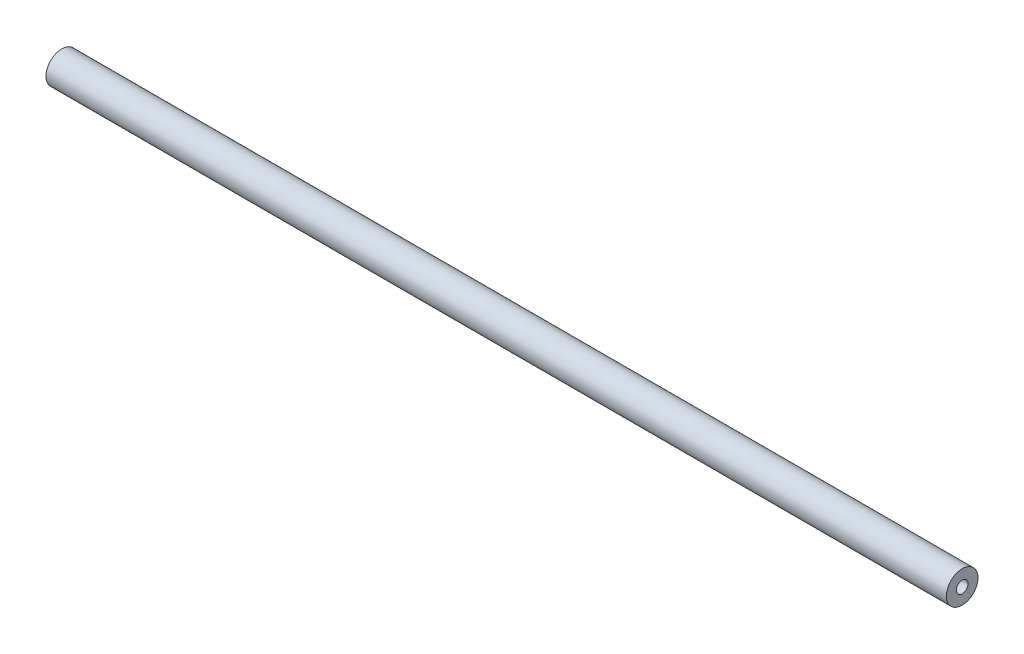
ISO-10303-21;
HEADER;
FILE_DESCRIPTION(('STEP AP214'),'2;1');
FILE_NAME('part.step','',(''),(''),'','','');
FILE_SCHEMA(('AUTOMOTIVE_DESIGN { 1 0 10303 214 1 1 1 1 }'));
ENDSEC;
DATA;
#1=APPLICATION_CONTEXT('core data for automotive mechanical design processes');
#2=APPLICATION_PROTOCOL_DEFINITION('international standard','automotive_design',2000,#1);
#3=PRODUCT_CONTEXT('',#1,'mechanical');
#4=PRODUCT('Part','Part','',(#3));
#5=PRODUCT_RELATED_PRODUCT_CATEGORY('part','',(#4));
#6=PRODUCT_DEFINITION_FORMATION('','',#4);
#7=PRODUCT_DEFINITION_CONTEXT('part definition',#1,'design');
#8=PRODUCT_DEFINITION('design','',#6,#7);
#9=PRODUCT_DEFINITION_SHAPE('','',#8);
#10=(LENGTH_UNIT() NAMED_UNIT(*) SI_UNIT(.MILLI.,.METRE.));
#11=(NAMED_UNIT(*) PLANE_ANGLE_UNIT() SI_UNIT($,.RADIAN.));
#12=(NAMED_UNIT(*) SI_UNIT($,.STERADIAN.) SOLID_ANGLE_UNIT());
#13=UNCERTAINTY_MEASURE_WITH_UNIT(LENGTH_MEASURE(1.E-05),#10,'distance_accuracy_value','');
#14=(GEOMETRIC_REPRESENTATION_CONTEXT(3) GLOBAL_UNCERTAINTY_ASSIGNED_CONTEXT((#13)) GLOBAL_UNIT_ASSIGNED_CONTEXT((#10,
#11,#12)) REPRESENTATION_CONTEXT('',''));
#15=CARTESIAN_POINT('',(0.,0.,0.));
#16=DIRECTION('',(0.,0.,1.));
#17=DIRECTION('',(1.,0.,0.));
#18=AXIS2_PLACEMENT_3D('',#15,#16,#17);
#19=CARTESIAN_POINT('',(723.9,0.,0.));
#20=DIRECTION('',(1.,0.,0.));
#21=DIRECTION('',(0.,0.,-1.));
#22=AXIS2_PLACEMENT_3D('',#19,#20,#21);
#23=PLANE('',#22);
#24=CARTESIAN_POINT('',(723.9,0.,0.));
#25=DIRECTION('',(1.,0.,0.));
#26=DIRECTION('',(0.,0.,-1.));
#27=AXIS2_PLACEMENT_3D('',#24,#25,#26);
#28=CIRCLE('',#27,12.7);
#29=CARTESIAN_POINT('',(723.9,0.,-12.7));
#30=VERTEX_POINT('',#29);
#31=EDGE_CURVE('E12',#30,#30,#28,.T.);
#32=ORIENTED_EDGE('',*,*,#31,.T.);
#33=EDGE_LOOP('',(#32));
#34=FACE_BOUND('',#33,.T.);
#35=CARTESIAN_POINT('',(723.9,0.,0.));
#36=DIRECTION('',(1.,0.,0.));
#37=DIRECTION('',(0.,0.,-1.));
#38=AXIS2_PLACEMENT_3D('',#35,#36,#37);
#39=CIRCLE('',#38,4.7625);
#40=CARTESIAN_POINT('',(723.9,0.,-4.7625));
#41=VERTEX_POINT('',#40);
#42=EDGE_CURVE('E55',#41,#41,#39,.T.);
#43=ORIENTED_EDGE('',*,*,#42,.F.);
#44=EDGE_LOOP('',(#43));
#45=FACE_BOUND('',#44,.T.);
#46=ADVANCED_FACE('F44',(#34,#45),#23,.T.);
#47=CARTESIAN_POINT('',(0.,0.,0.));
#48=DIRECTION('',(1.,0.,0.));
#49=DIRECTION('',(0.,0.,-1.));
#50=AXIS2_PLACEMENT_3D('',#47,#48,#49);
#51=PLANE('',#50);
#52=CARTESIAN_POINT('',(0.,0.,0.));
#53=DIRECTION('',(1.,0.,0.));
#54=DIRECTION('',(0.,0.,-1.));
#55=AXIS2_PLACEMENT_3D('',#52,#53,#54);
#56=CIRCLE('',#55,12.7);
#57=CARTESIAN_POINT('',(0.,0.,-12.7));
#58=VERTEX_POINT('',#57);
#59=EDGE_CURVE('E48',#58,#58,#56,.T.);
#60=ORIENTED_EDGE('',*,*,#59,.F.);
#61=EDGE_LOOP('',(#60));
#62=FACE_BOUND('',#61,.T.);
#63=CARTESIAN_POINT('',(0.,0.,0.));
#64=DIRECTION('',(1.,0.,0.));
#65=DIRECTION('',(0.,0.,-1.));
#66=AXIS2_PLACEMENT_3D('',#63,#64,#65);
#67=CIRCLE('',#66,4.7625);
#68=CARTESIAN_POINT('',(0.,0.,-4.7625));
#69=VERTEX_POINT('',#68);
#70=EDGE_CURVE('E57',#69,#69,#67,.T.);
#71=ORIENTED_EDGE('',*,*,#70,.T.);
#72=EDGE_LOOP('',(#71));
#73=FACE_BOUND('',#72,.T.);
#74=ADVANCED_FACE('F67',(#62,#73),#51,.F.);
#75=CARTESIAN_POINT('',(723.9,0.,0.));
#76=DIRECTION('',(-1.,0.,0.));
#77=DIRECTION('',(0.,0.,1.));
#78=AXIS2_PLACEMENT_3D('',#75,#76,#77);
#79=CYLINDRICAL_SURFACE('',#78,12.7);
#80=ORIENTED_EDGE('',*,*,#31,.F.);
#81=EDGE_LOOP('',(#80));
#82=FACE_BOUND('',#81,.T.);
#83=ORIENTED_EDGE('',*,*,#59,.T.);
#84=EDGE_LOOP('',(#83));
#85=FACE_BOUND('',#84,.T.);
#86=ADVANCED_FACE('F46',(#82,#85),#79,.T.);
#87=CARTESIAN_POINT('',(723.9,0.,0.));
#88=DIRECTION('',(-1.,0.,0.));
#89=DIRECTION('',(0.,0.,1.));
#90=AXIS2_PLACEMENT_3D('',#87,#88,#89);
#91=CYLINDRICAL_SURFACE('',#90,4.7625);
#92=ORIENTED_EDGE('',*,*,#42,.T.);
#93=EDGE_LOOP('',(#92));
#94=FACE_BOUND('',#93,.T.);
#95=ORIENTED_EDGE('',*,*,#70,.F.);
#96=EDGE_LOOP('',(#95));
#97=FACE_BOUND('',#96,.T.);
#98=ADVANCED_FACE('F63',(#94,#97),#91,.F.);
#99=CLOSED_SHELL('',(#46,#74,#86,#98));
#100=MANIFOLD_SOLID_BREP('B2',#99);
#101=ADVANCED_BREP_SHAPE_REPRESENTATION('',(#18,#100),#14);
#102=SHAPE_DEFINITION_REPRESENTATION(#9,#101);
ENDSEC;
END-ISO-10303-21;
